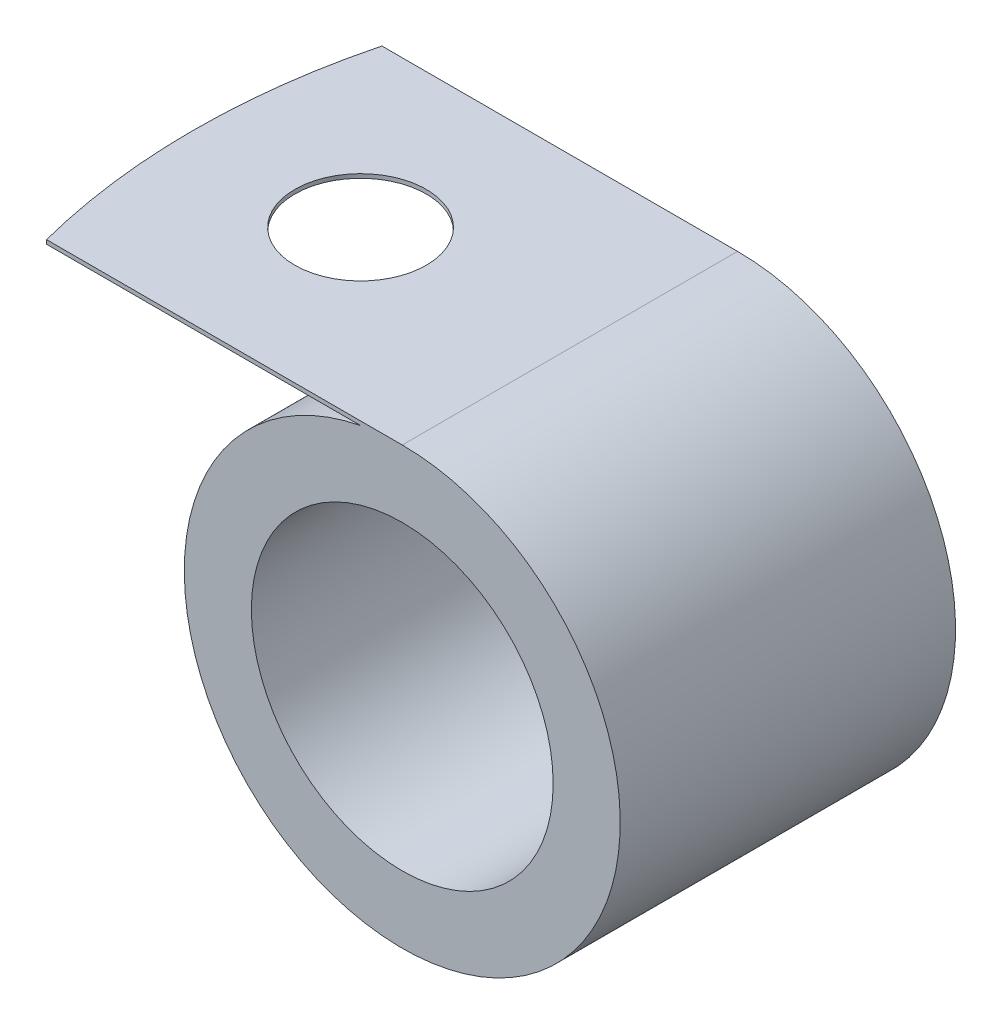
ISO-10303-21;
HEADER;
FILE_DESCRIPTION(('STEP AP214'),'2;1');
FILE_NAME('part.step','',(''),(''),'','','');
FILE_SCHEMA(('AUTOMOTIVE_DESIGN { 1 0 10303 214 1 1 1 1 }'));
ENDSEC;
DATA;
#1=APPLICATION_CONTEXT('core data for automotive mechanical design processes');
#2=APPLICATION_PROTOCOL_DEFINITION('international standard','automotive_design',2000,#1);
#3=PRODUCT_CONTEXT('',#1,'mechanical');
#4=PRODUCT('Part','Part','',(#3));
#5=PRODUCT_RELATED_PRODUCT_CATEGORY('part','',(#4));
#6=PRODUCT_DEFINITION_FORMATION('','',#4);
#7=PRODUCT_DEFINITION_CONTEXT('part definition',#1,'design');
#8=PRODUCT_DEFINITION('design','',#6,#7);
#9=PRODUCT_DEFINITION_SHAPE('','',#8);
#10=(LENGTH_UNIT() NAMED_UNIT(*) SI_UNIT(.MILLI.,.METRE.));
#11=(NAMED_UNIT(*) PLANE_ANGLE_UNIT() SI_UNIT($,.RADIAN.));
#12=(NAMED_UNIT(*) SI_UNIT($,.STERADIAN.) SOLID_ANGLE_UNIT());
#13=UNCERTAINTY_MEASURE_WITH_UNIT(LENGTH_MEASURE(1.E-05),#10,'distance_accuracy_value','');
#14=(GEOMETRIC_REPRESENTATION_CONTEXT(3) GLOBAL_UNCERTAINTY_ASSIGNED_CONTEXT((#13)) GLOBAL_UNIT_ASSIGNED_CONTEXT((#10,
#11,#12)) REPRESENTATION_CONTEXT('',''));
#15=CARTESIAN_POINT('',(0.,0.,0.));
#16=DIRECTION('',(0.,0.,1.));
#17=DIRECTION('',(1.,0.,0.));
#18=AXIS2_PLACEMENT_3D('',#15,#16,#17);
#19=CARTESIAN_POINT('',(0.,8.255,6.35));
#20=DIRECTION('',(0.,-1.,0.));
#21=DIRECTION('',(0.,0.,-1.));
#22=AXIS2_PLACEMENT_3D('',#19,#20,#21);
#23=PLANE('',#22);
#24=CARTESIAN_POINT('',(-7.92889145922068,8.255,0.));
#25=DIRECTION('',(0.,1.,0.));
#26=DIRECTION('',(0.,0.,1.));
#27=AXIS2_PLACEMENT_3D('',#24,#25,#26);
#28=CIRCLE('',#27,2.4892);
#29=CARTESIAN_POINT('',(-7.92889145922068,8.255,2.4892));
#30=VERTEX_POINT('',#29);
#31=EDGE_CURVE('E109',#30,#30,#28,.T.);
#32=ORIENTED_EDGE('',*,*,#31,.F.);
#33=EDGE_LOOP('',(#32));
#34=FACE_BOUND('',#33,.T.);
#35=CARTESIAN_POINT('',(11.1211085407793,8.255,0.));
#36=DIRECTION('',(0.,1.,0.));
#37=DIRECTION('',(0.,0.,1.));
#38=AXIS2_PLACEMENT_3D('',#35,#36,#37);
#39=CIRCLE('',#38,25.4);
#40=CARTESIAN_POINT('',(-13.4723357076378,8.255,-6.35));
#41=VERTEX_POINT('',#40);
#42=CARTESIAN_POINT('',(-13.4723357076378,8.255,6.35));
#43=VERTEX_POINT('',#42);
#44=EDGE_CURVE('E47',#41,#43,#39,.T.);
#45=ORIENTED_EDGE('',*,*,#44,.T.);
#46=DIRECTION('',(-1.,0.,0.));
#47=VECTOR('',#46,1.);
#48=CARTESIAN_POINT('',(0.,8.255,6.35));
#49=LINE('',#48,#47);
#50=CARTESIAN_POINT('',(0.,8.255,6.35));
#51=VERTEX_POINT('',#50);
#52=EDGE_CURVE('E97',#51,#43,#49,.T.);
#53=ORIENTED_EDGE('',*,*,#52,.F.);
#54=DIRECTION('',(0.,0.,-1.));
#55=VECTOR('',#54,1.);
#56=CARTESIAN_POINT('',(0.,8.255,6.35));
#57=LINE('',#56,#55);
#58=CARTESIAN_POINT('',(0.,8.255,-6.35));
#59=VERTEX_POINT('',#58);
#60=EDGE_CURVE('E11',#51,#59,#57,.T.);
#61=ORIENTED_EDGE('',*,*,#60,.T.);
#62=DIRECTION('',(-1.,0.,0.));
#63=VECTOR('',#62,1.);
#64=CARTESIAN_POINT('',(0.,8.255,-6.35));
#65=LINE('',#64,#63);
#66=EDGE_CURVE('E79',#59,#41,#65,.T.);
#67=ORIENTED_EDGE('',*,*,#66,.T.);
#68=EDGE_LOOP('',(#45,#53,#61,#67));
#69=FACE_BOUND('',#68,.T.);
#70=ADVANCED_FACE('F32',(#34,#69),#23,.F.);
#71=CARTESIAN_POINT('',(0.,8.1026,6.35));
#72=DIRECTION('',(0.,1.,0.));
#73=DIRECTION('',(-1.,0.,0.));
#74=AXIS2_PLACEMENT_3D('',#71,#72,#73);
#75=PLANE('',#74);
#76=CARTESIAN_POINT('',(-7.92889145922068,8.1026,0.));
#77=DIRECTION('',(0.,1.,0.));
#78=DIRECTION('',(-1.,0.,0.));
#79=AXIS2_PLACEMENT_3D('',#76,#77,#78);
#80=CIRCLE('',#79,2.4892);
#81=CARTESIAN_POINT('',(-10.4180914592207,8.1026,0.));
#82=VERTEX_POINT('',#81);
#83=EDGE_CURVE('E108',#82,#82,#80,.F.);
#84=ORIENTED_EDGE('',*,*,#83,.F.);
#85=EDGE_LOOP('',(#84));
#86=FACE_BOUND('',#85,.T.);
#87=DIRECTION('',(1.,0.,0.));
#88=VECTOR('',#87,1.);
#89=CARTESIAN_POINT('',(0.,8.1026,6.35));
#90=LINE('',#89,#88);
#91=CARTESIAN_POINT('',(-13.4723357076378,8.1026,6.35));
#92=VERTEX_POINT('',#91);
#93=CARTESIAN_POINT('',(-1.5788914592207,8.1026,6.35));
#94=VERTEX_POINT('',#93);
#95=EDGE_CURVE('E56',#92,#94,#90,.T.);
#96=ORIENTED_EDGE('',*,*,#95,.F.);
#97=CARTESIAN_POINT('',(11.1211085407793,8.1026,0.));
#98=DIRECTION('',(0.,1.,0.));
#99=DIRECTION('',(-1.,0.,0.));
#100=AXIS2_PLACEMENT_3D('',#97,#98,#99);
#101=CIRCLE('',#100,25.4);
#102=CARTESIAN_POINT('',(-13.4723357076378,8.1026,-6.35));
#103=VERTEX_POINT('',#102);
#104=EDGE_CURVE('E75',#92,#103,#101,.F.);
#105=ORIENTED_EDGE('',*,*,#104,.T.);
#106=DIRECTION('',(1.,0.,0.));
#107=VECTOR('',#106,1.);
#108=CARTESIAN_POINT('',(0.,8.1026,-6.35));
#109=LINE('',#108,#107);
#110=CARTESIAN_POINT('',(-1.5788914592207,8.1026,-6.35));
#111=VERTEX_POINT('',#110);
#112=EDGE_CURVE('E70',#103,#111,#109,.T.);
#113=ORIENTED_EDGE('',*,*,#112,.T.);
#114=DIRECTION('',(0.,0.,-1.));
#115=VECTOR('',#114,1.);
#116=CARTESIAN_POINT('',(-1.5788914592207,8.1026,6.35));
#117=LINE('',#116,#115);
#118=EDGE_CURVE('E40',#94,#111,#117,.T.);
#119=ORIENTED_EDGE('',*,*,#118,.F.);
#120=EDGE_LOOP('',(#96,#105,#113,#119));
#121=FACE_BOUND('',#120,.T.);
#122=ADVANCED_FACE('F72',(#86,#121),#75,.F.);
#123=CARTESIAN_POINT('',(0.,0.,6.35));
#124=DIRECTION('',(0.,0.,1.));
#125=DIRECTION('',(1.,0.,0.));
#126=AXIS2_PLACEMENT_3D('',#123,#124,#125);
#127=PLANE('',#126);
#128=CARTESIAN_POINT('',(0.,0.,6.35));
#129=DIRECTION('',(0.,0.,1.));
#130=DIRECTION('',(1.,0.,0.));
#131=AXIS2_PLACEMENT_3D('',#128,#129,#130);
#132=CIRCLE('',#131,5.715);
#133=CARTESIAN_POINT('',(5.715,0.,6.35));
#134=VERTEX_POINT('',#133);
#135=EDGE_CURVE('E78',#134,#134,#132,.T.);
#136=ORIENTED_EDGE('',*,*,#135,.F.);
#137=EDGE_LOOP('',(#136));
#138=FACE_BOUND('',#137,.T.);
#139=ORIENTED_EDGE('',*,*,#52,.T.);
#140=DIRECTION('',(0.,1.,0.));
#141=VECTOR('',#140,1.);
#142=CARTESIAN_POINT('',(-13.4723357076378,-8.256,6.35));
#143=LINE('',#142,#141);
#144=EDGE_CURVE('E106',#92,#43,#143,.T.);
#145=ORIENTED_EDGE('',*,*,#144,.F.);
#146=ORIENTED_EDGE('',*,*,#95,.T.);
#147=CARTESIAN_POINT('',(0.,0.,6.35));
#148=DIRECTION('',(0.,0.,1.));
#149=DIRECTION('',(1.,0.,0.));
#150=AXIS2_PLACEMENT_3D('',#147,#148,#149);
#151=CIRCLE('',#150,8.255);
#152=EDGE_CURVE('E86',#94,#51,#151,.T.);
#153=ORIENTED_EDGE('',*,*,#152,.T.);
#154=EDGE_LOOP('',(#139,#145,#146,#153));
#155=FACE_BOUND('',#154,.T.);
#156=ADVANCED_FACE('F118',(#138,#155),#127,.T.);
#157=CARTESIAN_POINT('',(0.,0.,-6.35));
#158=DIRECTION('',(0.,0.,1.));
#159=DIRECTION('',(1.,0.,0.));
#160=AXIS2_PLACEMENT_3D('',#157,#158,#159);
#161=PLANE('',#160);
#162=CARTESIAN_POINT('',(0.,0.,-6.35));
#163=DIRECTION('',(0.,0.,1.));
#164=DIRECTION('',(1.,0.,0.));
#165=AXIS2_PLACEMENT_3D('',#162,#163,#164);
#166=CIRCLE('',#165,5.715);
#167=CARTESIAN_POINT('',(5.715,0.,-6.35));
#168=VERTEX_POINT('',#167);
#169=EDGE_CURVE('E89',#168,#168,#166,.T.);
#170=ORIENTED_EDGE('',*,*,#169,.T.);
#171=EDGE_LOOP('',(#170));
#172=FACE_BOUND('',#171,.T.);
#173=DIRECTION('',(0.,1.,0.));
#174=VECTOR('',#173,1.);
#175=CARTESIAN_POINT('',(-13.4723357076378,-8.256,-6.35));
#176=LINE('',#175,#174);
#177=EDGE_CURVE('E93',#103,#41,#176,.T.);
#178=ORIENTED_EDGE('',*,*,#177,.T.);
#179=ORIENTED_EDGE('',*,*,#66,.F.);
#180=CARTESIAN_POINT('',(0.,0.,-6.35));
#181=DIRECTION('',(0.,0.,1.));
#182=DIRECTION('',(1.,0.,0.));
#183=AXIS2_PLACEMENT_3D('',#180,#181,#182);
#184=CIRCLE('',#183,8.255);
#185=EDGE_CURVE('E85',#111,#59,#184,.T.);
#186=ORIENTED_EDGE('',*,*,#185,.F.);
#187=ORIENTED_EDGE('',*,*,#112,.F.);
#188=EDGE_LOOP('',(#178,#179,#186,#187));
#189=FACE_BOUND('',#188,.T.);
#190=ADVANCED_FACE('F87',(#172,#189),#161,.F.);
#191=CARTESIAN_POINT('',(0.,0.,6.35));
#192=DIRECTION('',(0.,0.,-1.));
#193=DIRECTION('',(-1.,0.,0.));
#194=AXIS2_PLACEMENT_3D('',#191,#192,#193);
#195=CYLINDRICAL_SURFACE('',#194,8.255);
#196=ORIENTED_EDGE('',*,*,#185,.T.);
#197=ORIENTED_EDGE('',*,*,#60,.F.);
#198=ORIENTED_EDGE('',*,*,#152,.F.);
#199=ORIENTED_EDGE('',*,*,#118,.T.);
#200=EDGE_LOOP('',(#196,#197,#198,#199));
#201=FACE_BOUND('',#200,.T.);
#202=ADVANCED_FACE('F83',(#201),#195,.T.);
#203=CARTESIAN_POINT('',(0.,0.,6.35));
#204=DIRECTION('',(0.,0.,-1.));
#205=DIRECTION('',(-1.,0.,0.));
#206=AXIS2_PLACEMENT_3D('',#203,#204,#205);
#207=CYLINDRICAL_SURFACE('',#206,5.715);
#208=ORIENTED_EDGE('',*,*,#135,.T.);
#209=EDGE_LOOP('',(#208));
#210=FACE_BOUND('',#209,.T.);
#211=ORIENTED_EDGE('',*,*,#169,.F.);
#212=EDGE_LOOP('',(#211));
#213=FACE_BOUND('',#212,.T.);
#214=ADVANCED_FACE('F34',(#210,#213),#207,.F.);
#215=CARTESIAN_POINT('',(11.1211085407793,-8.256,0.));
#216=DIRECTION('',(0.,1.,0.));
#217=DIRECTION('',(0.,0.,1.));
#218=AXIS2_PLACEMENT_3D('',#215,#216,#217);
#219=CYLINDRICAL_SURFACE('',#218,25.4);
#220=ORIENTED_EDGE('',*,*,#104,.F.);
#221=ORIENTED_EDGE('',*,*,#144,.T.);
#222=ORIENTED_EDGE('',*,*,#44,.F.);
#223=ORIENTED_EDGE('',*,*,#177,.F.);
#224=EDGE_LOOP('',(#220,#221,#222,#223));
#225=FACE_BOUND('',#224,.T.);
#226=ADVANCED_FACE('F134',(#225),#219,.T.);
#227=CARTESIAN_POINT('',(-7.92889145922068,-8.256,0.));
#228=DIRECTION('',(0.,1.,0.));
#229=DIRECTION('',(0.,0.,1.));
#230=AXIS2_PLACEMENT_3D('',#227,#228,#229);
#231=CYLINDRICAL_SURFACE('',#230,2.4892);
#232=ORIENTED_EDGE('',*,*,#31,.T.);
#233=EDGE_LOOP('',(#232));
#234=FACE_BOUND('',#233,.T.);
#235=ORIENTED_EDGE('',*,*,#83,.T.);
#236=EDGE_LOOP('',(#235));
#237=FACE_BOUND('',#236,.T.);
#238=ADVANCED_FACE('F115',(#234,#237),#231,.F.);
#239=CLOSED_SHELL('',(#70,#122,#156,#190,#202,#214,#226,#238));
#240=MANIFOLD_SOLID_BREP('B2',#239);
#241=ADVANCED_BREP_SHAPE_REPRESENTATION('',(#18,#240),#14);
#242=SHAPE_DEFINITION_REPRESENTATION(#9,#241);
ENDSEC;
END-ISO-10303-21;
